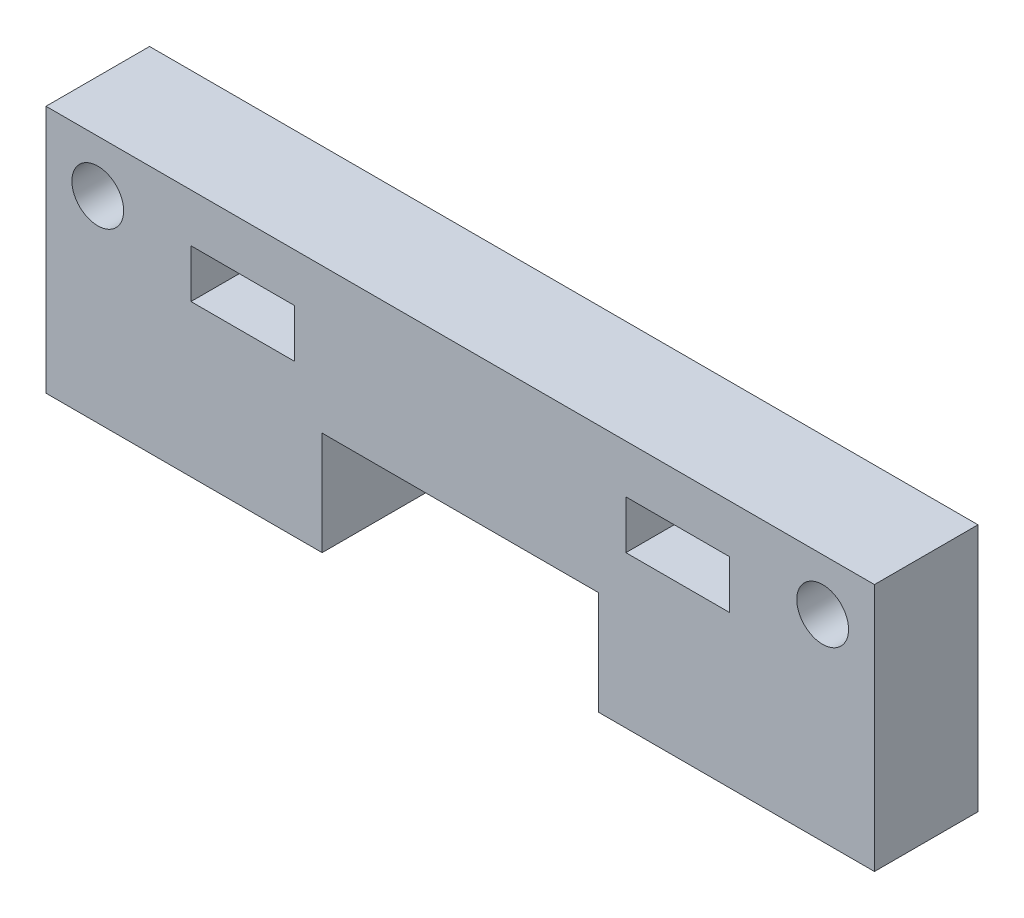
ISO-10303-21;
HEADER;
FILE_DESCRIPTION(('STEP AP214'),'2;1');
FILE_NAME('part.step','',(''),(''),'','','');
FILE_SCHEMA(('AUTOMOTIVE_DESIGN { 1 0 10303 214 1 1 1 1 }'));
ENDSEC;
DATA;
#1=APPLICATION_CONTEXT('core data for automotive mechanical design processes');
#2=APPLICATION_PROTOCOL_DEFINITION('international standard','automotive_design',2000,#1);
#3=PRODUCT_CONTEXT('',#1,'mechanical');
#4=PRODUCT('Part','Part','',(#3));
#5=PRODUCT_RELATED_PRODUCT_CATEGORY('part','',(#4));
#6=PRODUCT_DEFINITION_FORMATION('','',#4);
#7=PRODUCT_DEFINITION_CONTEXT('part definition',#1,'design');
#8=PRODUCT_DEFINITION('design','',#6,#7);
#9=PRODUCT_DEFINITION_SHAPE('','',#8);
#10=(LENGTH_UNIT() NAMED_UNIT(*) SI_UNIT(.MILLI.,.METRE.));
#11=(NAMED_UNIT(*) PLANE_ANGLE_UNIT() SI_UNIT($,.RADIAN.));
#12=(NAMED_UNIT(*) SI_UNIT($,.STERADIAN.) SOLID_ANGLE_UNIT());
#13=UNCERTAINTY_MEASURE_WITH_UNIT(LENGTH_MEASURE(1.E-05),#10,'distance_accuracy_value','');
#14=(GEOMETRIC_REPRESENTATION_CONTEXT(3) GLOBAL_UNCERTAINTY_ASSIGNED_CONTEXT((#13)) GLOBAL_UNIT_ASSIGNED_CONTEXT((#10,
#11,#12)) REPRESENTATION_CONTEXT('',''));
#15=CARTESIAN_POINT('',(0.,0.,0.));
#16=DIRECTION('',(0.,0.,1.));
#17=DIRECTION('',(1.,0.,0.));
#18=AXIS2_PLACEMENT_3D('',#15,#16,#17);
#19=CARTESIAN_POINT('',(0.,0.,0.));
#20=DIRECTION('',(0.,0.,-1.));
#21=DIRECTION('',(-1.,0.,0.));
#22=AXIS2_PLACEMENT_3D('',#19,#20,#21);
#23=PLANE('',#22);
#24=DIRECTION('',(1.,0.,0.));
#25=VECTOR('',#24,1.);
#26=CARTESIAN_POINT('',(35.56,12.2766666666667,0.));
#27=LINE('',#26,#25);
#28=CARTESIAN_POINT('',(35.56,12.2766666666667,0.));
#29=VERTEX_POINT('',#28);
#30=CARTESIAN_POINT('',(41.91,12.2766666666667,0.));
#31=VERTEX_POINT('',#30);
#32=EDGE_CURVE('E196',#29,#31,#27,.T.);
#33=ORIENTED_EDGE('',*,*,#32,.F.);
#34=DIRECTION('',(0.,-1.,0.));
#35=VECTOR('',#34,1.);
#36=CARTESIAN_POINT('',(35.56,12.2766666666667,0.));
#37=LINE('',#36,#35);
#38=CARTESIAN_POINT('',(35.56,9.31333333333334,0.));
#39=VERTEX_POINT('',#38);
#40=EDGE_CURVE('E177',#29,#39,#37,.T.);
#41=ORIENTED_EDGE('',*,*,#40,.T.);
#42=DIRECTION('',(1.,0.,0.));
#43=VECTOR('',#42,1.);
#44=CARTESIAN_POINT('',(35.56,9.31333333333334,0.));
#45=LINE('',#44,#43);
#46=CARTESIAN_POINT('',(41.91,9.31333333333334,0.));
#47=VERTEX_POINT('',#46);
#48=EDGE_CURVE('E198',#39,#47,#45,.T.);
#49=ORIENTED_EDGE('',*,*,#48,.T.);
#50=DIRECTION('',(0.,-1.,0.));
#51=VECTOR('',#50,1.);
#52=CARTESIAN_POINT('',(41.91,12.2766666666667,0.));
#53=LINE('',#52,#51);
#54=EDGE_CURVE('E187',#31,#47,#53,.T.);
#55=ORIENTED_EDGE('',*,*,#54,.F.);
#56=EDGE_LOOP('',(#33,#41,#49,#55));
#57=FACE_BOUND('',#56,.T.);
#58=CARTESIAN_POINT('',(47.625,12.065,0.));
#59=DIRECTION('',(0.,0.,1.));
#60=DIRECTION('',(1.,0.,0.));
#61=AXIS2_PLACEMENT_3D('',#58,#59,#60);
#62=CIRCLE('',#61,1.5875);
#63=CARTESIAN_POINT('',(49.2125,12.065,0.));
#64=VERTEX_POINT('',#63);
#65=EDGE_CURVE('E195',#64,#64,#62,.T.);
#66=ORIENTED_EDGE('',*,*,#65,.T.);
#67=EDGE_LOOP('',(#66));
#68=FACE_BOUND('',#67,.T.);
#69=CARTESIAN_POINT('',(3.175,12.065,0.));
#70=DIRECTION('',(0.,0.,1.));
#71=DIRECTION('',(1.,0.,0.));
#72=AXIS2_PLACEMENT_3D('',#69,#70,#71);
#73=CIRCLE('',#72,1.5875);
#74=CARTESIAN_POINT('',(4.7625,12.065,0.));
#75=VERTEX_POINT('',#74);
#76=EDGE_CURVE('E209',#75,#75,#73,.T.);
#77=ORIENTED_EDGE('',*,*,#76,.T.);
#78=EDGE_LOOP('',(#77));
#79=FACE_BOUND('',#78,.T.);
#80=DIRECTION('',(1.,0.,0.));
#81=VECTOR('',#80,1.);
#82=CARTESIAN_POINT('',(16.9333333333333,6.35,0.));
#83=LINE('',#82,#81);
#84=CARTESIAN_POINT('',(16.9333333333333,6.35,0.));
#85=VERTEX_POINT('',#84);
#86=CARTESIAN_POINT('',(33.8666666666667,6.35,0.));
#87=VERTEX_POINT('',#86);
#88=EDGE_CURVE('E223',#85,#87,#83,.T.);
#89=ORIENTED_EDGE('',*,*,#88,.F.);
#90=DIRECTION('',(0.,1.,0.));
#91=VECTOR('',#90,1.);
#92=CARTESIAN_POINT('',(16.9333333333333,0.,0.));
#93=LINE('',#92,#91);
#94=CARTESIAN_POINT('',(16.9333333333333,0.,0.));
#95=VERTEX_POINT('',#94);
#96=EDGE_CURVE('E231',#95,#85,#93,.T.);
#97=ORIENTED_EDGE('',*,*,#96,.F.);
#98=DIRECTION('',(1.,0.,0.));
#99=VECTOR('',#98,1.);
#100=CARTESIAN_POINT('',(0.,0.,0.));
#101=LINE('',#100,#99);
#102=CARTESIAN_POINT('',(0.,0.,0.));
#103=VERTEX_POINT('',#102);
#104=EDGE_CURVE('E255',#103,#95,#101,.T.);
#105=ORIENTED_EDGE('',*,*,#104,.F.);
#106=DIRECTION('',(0.,-1.,0.));
#107=VECTOR('',#106,1.);
#108=CARTESIAN_POINT('',(0.,0.,0.));
#109=LINE('',#108,#107);
#110=CARTESIAN_POINT('',(0.,15.24,0.));
#111=VERTEX_POINT('',#110);
#112=EDGE_CURVE('E239',#111,#103,#109,.T.);
#113=ORIENTED_EDGE('',*,*,#112,.F.);
#114=DIRECTION('',(-1.,0.,0.));
#115=VECTOR('',#114,1.);
#116=CARTESIAN_POINT('',(0.,15.24,0.));
#117=LINE('',#116,#115);
#118=CARTESIAN_POINT('',(50.8,15.24,0.));
#119=VERTEX_POINT('',#118);
#120=EDGE_CURVE('E243',#119,#111,#117,.T.);
#121=ORIENTED_EDGE('',*,*,#120,.F.);
#122=DIRECTION('',(0.,1.,0.));
#123=VECTOR('',#122,1.);
#124=CARTESIAN_POINT('',(50.8,0.,0.));
#125=LINE('',#124,#123);
#126=CARTESIAN_POINT('',(50.8,0.,0.));
#127=VERTEX_POINT('',#126);
#128=EDGE_CURVE('E258',#127,#119,#125,.T.);
#129=ORIENTED_EDGE('',*,*,#128,.F.);
#130=CARTESIAN_POINT('',(33.8666666666667,0.,0.));
#131=VERTEX_POINT('',#130);
#132=EDGE_CURVE('E254',#131,#127,#101,.T.);
#133=ORIENTED_EDGE('',*,*,#132,.F.);
#134=DIRECTION('',(0.,1.,0.));
#135=VECTOR('',#134,1.);
#136=CARTESIAN_POINT('',(33.8666666666667,0.,0.));
#137=LINE('',#136,#135);
#138=EDGE_CURVE('E228',#131,#87,#137,.T.);
#139=ORIENTED_EDGE('',*,*,#138,.T.);
#140=EDGE_LOOP('',(#89,#97,#105,#113,#121,#129,#133,#139));
#141=FACE_BOUND('',#140,.T.);
#142=DIRECTION('',(1.,0.,0.));
#143=VECTOR('',#142,1.);
#144=CARTESIAN_POINT('',(8.88999999999999,12.2766666666667,0.));
#145=LINE('',#144,#143);
#146=CARTESIAN_POINT('',(8.88999999999999,12.2766666666667,0.));
#147=VERTEX_POINT('',#146);
#148=CARTESIAN_POINT('',(15.24,12.2766666666667,0.));
#149=VERTEX_POINT('',#148);
#150=EDGE_CURVE('E50',#147,#149,#145,.T.);
#151=ORIENTED_EDGE('',*,*,#150,.F.);
#152=DIRECTION('',(0.,-1.,0.));
#153=VECTOR('',#152,1.);
#154=CARTESIAN_POINT('',(8.88999999999999,12.2766666666667,0.));
#155=LINE('',#154,#153);
#156=CARTESIAN_POINT('',(8.88999999999999,9.31333333333334,0.));
#157=VERTEX_POINT('',#156);
#158=EDGE_CURVE('E164',#147,#157,#155,.T.);
#159=ORIENTED_EDGE('',*,*,#158,.T.);
#160=DIRECTION('',(1.,0.,0.));
#161=VECTOR('',#160,1.);
#162=CARTESIAN_POINT('',(8.88999999999999,9.31333333333334,0.));
#163=LINE('',#162,#161);
#164=CARTESIAN_POINT('',(15.24,9.31333333333334,0.));
#165=VERTEX_POINT('',#164);
#166=EDGE_CURVE('E163',#157,#165,#163,.T.);
#167=ORIENTED_EDGE('',*,*,#166,.T.);
#168=DIRECTION('',(0.,-1.,0.));
#169=VECTOR('',#168,1.);
#170=CARTESIAN_POINT('',(15.24,12.2766666666667,0.));
#171=LINE('',#170,#169);
#172=EDGE_CURVE('E306',#149,#165,#171,.T.);
#173=ORIENTED_EDGE('',*,*,#172,.F.);
#174=EDGE_LOOP('',(#151,#159,#167,#173));
#175=FACE_BOUND('',#174,.T.);
#176=ADVANCED_FACE('F35',(#57,#68,#79,#141,#175),#23,.T.);
#177=CARTESIAN_POINT('',(0.,0.,6.35));
#178=DIRECTION('',(0.,1.,0.));
#179=DIRECTION('',(0.,0.,1.));
#180=AXIS2_PLACEMENT_3D('',#177,#178,#179);
#181=PLANE('',#180);
#182=DIRECTION('',(0.,0.,-1.));
#183=VECTOR('',#182,1.);
#184=CARTESIAN_POINT('',(16.9333333333333,0.,0.));
#185=LINE('',#184,#183);
#186=CARTESIAN_POINT('',(16.9333333333333,0.,6.35000000000002));
#187=VERTEX_POINT('',#186);
#188=EDGE_CURVE('E215',#187,#95,#185,.T.);
#189=ORIENTED_EDGE('',*,*,#188,.F.);
#190=DIRECTION('',(1.,0.,0.));
#191=VECTOR('',#190,1.);
#192=CARTESIAN_POINT('',(0.,0.,6.35));
#193=LINE('',#192,#191);
#194=CARTESIAN_POINT('',(0.,0.,6.35));
#195=VERTEX_POINT('',#194);
#196=EDGE_CURVE('E244',#195,#187,#193,.T.);
#197=ORIENTED_EDGE('',*,*,#196,.F.);
#198=DIRECTION('',(0.,0.,-1.));
#199=VECTOR('',#198,1.);
#200=CARTESIAN_POINT('',(0.,0.,6.35));
#201=LINE('',#200,#199);
#202=EDGE_CURVE('E269',#195,#103,#201,.T.);
#203=ORIENTED_EDGE('',*,*,#202,.T.);
#204=ORIENTED_EDGE('',*,*,#104,.T.);
#205=EDGE_LOOP('',(#189,#197,#203,#204));
#206=FACE_BOUND('',#205,.T.);
#207=ADVANCED_FACE('F296',(#206),#181,.F.);
#208=DIRECTION('',(0.,0.,1.));
#209=VECTOR('',#208,1.);
#210=CARTESIAN_POINT('',(33.8666666666667,0.,0.));
#211=LINE('',#210,#209);
#212=CARTESIAN_POINT('',(33.8666666666667,0.,6.35000000000002));
#213=VERTEX_POINT('',#212);
#214=EDGE_CURVE('E217',#131,#213,#211,.T.);
#215=ORIENTED_EDGE('',*,*,#214,.F.);
#216=ORIENTED_EDGE('',*,*,#132,.T.);
#217=DIRECTION('',(0.,0.,-1.));
#218=VECTOR('',#217,1.);
#219=CARTESIAN_POINT('',(50.8,0.,6.35));
#220=LINE('',#219,#218);
#221=CARTESIAN_POINT('',(50.8,0.,6.35));
#222=VERTEX_POINT('',#221);
#223=EDGE_CURVE('E266',#222,#127,#220,.T.);
#224=ORIENTED_EDGE('',*,*,#223,.F.);
#225=EDGE_CURVE('E242',#213,#222,#193,.T.);
#226=ORIENTED_EDGE('',*,*,#225,.F.);
#227=EDGE_LOOP('',(#215,#216,#224,#226));
#228=FACE_BOUND('',#227,.T.);
#229=ADVANCED_FACE('F362',(#228),#181,.F.);
#230=CARTESIAN_POINT('',(0.,0.,6.35));
#231=DIRECTION('',(1.,0.,0.));
#232=DIRECTION('',(0.,0.,-1.));
#233=AXIS2_PLACEMENT_3D('',#230,#231,#232);
#234=PLANE('',#233);
#235=ORIENTED_EDGE('',*,*,#112,.T.);
#236=ORIENTED_EDGE('',*,*,#202,.F.);
#237=DIRECTION('',(0.,-1.,0.));
#238=VECTOR('',#237,1.);
#239=CARTESIAN_POINT('',(0.,0.,6.35));
#240=LINE('',#239,#238);
#241=CARTESIAN_POINT('',(0.,15.24,6.35));
#242=VERTEX_POINT('',#241);
#243=EDGE_CURVE('E240',#242,#195,#240,.T.);
#244=ORIENTED_EDGE('',*,*,#243,.F.);
#245=DIRECTION('',(0.,0.,-1.));
#246=VECTOR('',#245,1.);
#247=CARTESIAN_POINT('',(0.,15.24,6.35));
#248=LINE('',#247,#246);
#249=EDGE_CURVE('E251',#242,#111,#248,.T.);
#250=ORIENTED_EDGE('',*,*,#249,.T.);
#251=EDGE_LOOP('',(#235,#236,#244,#250));
#252=FACE_BOUND('',#251,.T.);
#253=ADVANCED_FACE('F37',(#252),#234,.F.);
#254=CARTESIAN_POINT('',(50.8,0.,6.35));
#255=DIRECTION('',(-1.,0.,0.));
#256=DIRECTION('',(0.,0.,1.));
#257=AXIS2_PLACEMENT_3D('',#254,#255,#256);
#258=PLANE('',#257);
#259=ORIENTED_EDGE('',*,*,#128,.T.);
#260=DIRECTION('',(0.,0.,-1.));
#261=VECTOR('',#260,1.);
#262=CARTESIAN_POINT('',(50.8,15.24,6.35));
#263=LINE('',#262,#261);
#264=CARTESIAN_POINT('',(50.8,15.24,6.35));
#265=VERTEX_POINT('',#264);
#266=EDGE_CURVE('E263',#265,#119,#263,.T.);
#267=ORIENTED_EDGE('',*,*,#266,.F.);
#268=DIRECTION('',(0.,1.,0.));
#269=VECTOR('',#268,1.);
#270=CARTESIAN_POINT('',(50.8,0.,6.35));
#271=LINE('',#270,#269);
#272=EDGE_CURVE('E247',#222,#265,#271,.T.);
#273=ORIENTED_EDGE('',*,*,#272,.F.);
#274=ORIENTED_EDGE('',*,*,#223,.T.);
#275=EDGE_LOOP('',(#259,#267,#273,#274));
#276=FACE_BOUND('',#275,.T.);
#277=ADVANCED_FACE('F357',(#276),#258,.F.);
#278=CARTESIAN_POINT('',(0.,15.24,6.35));
#279=DIRECTION('',(0.,-1.,0.));
#280=DIRECTION('',(0.,0.,-1.));
#281=AXIS2_PLACEMENT_3D('',#278,#279,#280);
#282=PLANE('',#281);
#283=ORIENTED_EDGE('',*,*,#120,.T.);
#284=ORIENTED_EDGE('',*,*,#249,.F.);
#285=DIRECTION('',(-1.,0.,0.));
#286=VECTOR('',#285,1.);
#287=CARTESIAN_POINT('',(0.,15.24,6.35));
#288=LINE('',#287,#286);
#289=EDGE_CURVE('E249',#265,#242,#288,.T.);
#290=ORIENTED_EDGE('',*,*,#289,.F.);
#291=ORIENTED_EDGE('',*,*,#266,.T.);
#292=EDGE_LOOP('',(#283,#284,#290,#291));
#293=FACE_BOUND('',#292,.T.);
#294=ADVANCED_FACE('F353',(#293),#282,.F.);
#295=CARTESIAN_POINT('',(0.,0.,6.35));
#296=DIRECTION('',(0.,0.,-1.));
#297=DIRECTION('',(-1.,0.,0.));
#298=AXIS2_PLACEMENT_3D('',#295,#296,#297);
#299=PLANE('',#298);
#300=DIRECTION('',(0.,-1.,0.));
#301=VECTOR('',#300,1.);
#302=CARTESIAN_POINT('',(8.88999999999999,0.,6.35));
#303=LINE('',#302,#301);
#304=CARTESIAN_POINT('',(8.88999999999999,12.2766666666667,6.35));
#305=VERTEX_POINT('',#304);
#306=CARTESIAN_POINT('',(8.88999999999999,9.31333333333334,6.35));
#307=VERTEX_POINT('',#306);
#308=EDGE_CURVE('E11',#305,#307,#303,.T.);
#309=ORIENTED_EDGE('',*,*,#308,.F.);
#310=DIRECTION('',(1.,0.,0.));
#311=VECTOR('',#310,1.);
#312=CARTESIAN_POINT('',(8.88999999999999,12.2766666666667,6.35));
#313=LINE('',#312,#311);
#314=CARTESIAN_POINT('',(15.24,12.2766666666667,6.35));
#315=VERTEX_POINT('',#314);
#316=EDGE_CURVE('E188',#305,#315,#313,.T.);
#317=ORIENTED_EDGE('',*,*,#316,.T.);
#318=DIRECTION('',(0.,-1.,0.));
#319=VECTOR('',#318,1.);
#320=CARTESIAN_POINT('',(15.24,0.,6.35));
#321=LINE('',#320,#319);
#322=CARTESIAN_POINT('',(15.24,9.31333333333334,6.35));
#323=VERTEX_POINT('',#322);
#324=EDGE_CURVE('E43',#315,#323,#321,.T.);
#325=ORIENTED_EDGE('',*,*,#324,.T.);
#326=DIRECTION('',(1.,0.,0.));
#327=VECTOR('',#326,1.);
#328=CARTESIAN_POINT('',(8.88999999999999,9.31333333333334,6.35));
#329=LINE('',#328,#327);
#330=EDGE_CURVE('E160',#307,#323,#329,.T.);
#331=ORIENTED_EDGE('',*,*,#330,.F.);
#332=EDGE_LOOP('',(#309,#317,#325,#331));
#333=FACE_BOUND('',#332,.T.);
#334=ORIENTED_EDGE('',*,*,#289,.T.);
#335=ORIENTED_EDGE('',*,*,#243,.T.);
#336=ORIENTED_EDGE('',*,*,#196,.T.);
#337=DIRECTION('',(0.,1.,0.));
#338=VECTOR('',#337,1.);
#339=CARTESIAN_POINT('',(16.9333333333333,0.,6.35000000000002));
#340=LINE('',#339,#338);
#341=CARTESIAN_POINT('',(16.9333333333333,6.35,6.35000000000002));
#342=VERTEX_POINT('',#341);
#343=EDGE_CURVE('E233',#187,#342,#340,.T.);
#344=ORIENTED_EDGE('',*,*,#343,.T.);
#345=DIRECTION('',(1.,0.,0.));
#346=VECTOR('',#345,1.);
#347=CARTESIAN_POINT('',(0.,6.35,6.35));
#348=LINE('',#347,#346);
#349=CARTESIAN_POINT('',(33.8666666666667,6.35,6.35000000000002));
#350=VERTEX_POINT('',#349);
#351=EDGE_CURVE('E236',#342,#350,#348,.T.);
#352=ORIENTED_EDGE('',*,*,#351,.T.);
#353=DIRECTION('',(0.,1.,0.));
#354=VECTOR('',#353,1.);
#355=CARTESIAN_POINT('',(33.8666666666667,0.,6.35000000000002));
#356=LINE('',#355,#354);
#357=EDGE_CURVE('E220',#213,#350,#356,.T.);
#358=ORIENTED_EDGE('',*,*,#357,.F.);
#359=ORIENTED_EDGE('',*,*,#225,.T.);
#360=ORIENTED_EDGE('',*,*,#272,.T.);
#361=EDGE_LOOP('',(#334,#335,#336,#344,#352,#358,#359,#360));
#362=FACE_BOUND('',#361,.T.);
#363=CARTESIAN_POINT('',(47.625,12.065,6.35));
#364=DIRECTION('',(0.,0.,1.));
#365=DIRECTION('',(1.,0.,0.));
#366=AXIS2_PLACEMENT_3D('',#363,#364,#365);
#367=CIRCLE('',#366,1.5875);
#368=CARTESIAN_POINT('',(49.2125,12.065,6.35));
#369=VERTEX_POINT('',#368);
#370=EDGE_CURVE('E203',#369,#369,#367,.T.);
#371=ORIENTED_EDGE('',*,*,#370,.F.);
#372=EDGE_LOOP('',(#371));
#373=FACE_BOUND('',#372,.T.);
#374=CARTESIAN_POINT('',(3.175,12.065,6.35));
#375=DIRECTION('',(0.,0.,1.));
#376=DIRECTION('',(1.,0.,0.));
#377=AXIS2_PLACEMENT_3D('',#374,#375,#376);
#378=CIRCLE('',#377,1.5875);
#379=CARTESIAN_POINT('',(4.7625,12.065,6.35));
#380=VERTEX_POINT('',#379);
#381=EDGE_CURVE('E206',#380,#380,#378,.T.);
#382=ORIENTED_EDGE('',*,*,#381,.F.);
#383=EDGE_LOOP('',(#382));
#384=FACE_BOUND('',#383,.T.);
#385=DIRECTION('',(0.,-1.,0.));
#386=VECTOR('',#385,1.);
#387=CARTESIAN_POINT('',(35.56,0.,6.35));
#388=LINE('',#387,#386);
#389=CARTESIAN_POINT('',(35.56,12.2766666666667,6.35));
#390=VERTEX_POINT('',#389);
#391=CARTESIAN_POINT('',(35.56,9.31333333333334,6.35));
#392=VERTEX_POINT('',#391);
#393=EDGE_CURVE('E275',#390,#392,#388,.T.);
#394=ORIENTED_EDGE('',*,*,#393,.F.);
#395=DIRECTION('',(1.,0.,0.));
#396=VECTOR('',#395,1.);
#397=CARTESIAN_POINT('',(35.56,12.2766666666667,6.35));
#398=LINE('',#397,#396);
#399=CARTESIAN_POINT('',(41.91,12.2766666666667,6.35));
#400=VERTEX_POINT('',#399);
#401=EDGE_CURVE('E192',#390,#400,#398,.T.);
#402=ORIENTED_EDGE('',*,*,#401,.T.);
#403=DIRECTION('',(0.,-1.,0.));
#404=VECTOR('',#403,1.);
#405=CARTESIAN_POINT('',(41.91,0.,6.35));
#406=LINE('',#405,#404);
#407=CARTESIAN_POINT('',(41.91,9.31333333333334,6.35));
#408=VERTEX_POINT('',#407);
#409=EDGE_CURVE('E272',#400,#408,#406,.T.);
#410=ORIENTED_EDGE('',*,*,#409,.T.);
#411=DIRECTION('',(1.,0.,0.));
#412=VECTOR('',#411,1.);
#413=CARTESIAN_POINT('',(35.56,9.31333333333334,6.35));
#414=LINE('',#413,#412);
#415=EDGE_CURVE('E183',#392,#408,#414,.T.);
#416=ORIENTED_EDGE('',*,*,#415,.F.);
#417=EDGE_LOOP('',(#394,#402,#410,#416));
#418=FACE_BOUND('',#417,.T.);
#419=ADVANCED_FACE('F167',(#333,#362,#373,#384,#418),#299,.F.);
#420=CARTESIAN_POINT('',(0.,6.35,2.7589655172414));
#421=DIRECTION('',(0.,1.,0.));
#422=DIRECTION('',(-1.,0.,0.));
#423=AXIS2_PLACEMENT_3D('',#420,#421,#422);
#424=PLANE('',#423);
#425=DIRECTION('',(0.,0.,-1.));
#426=VECTOR('',#425,1.);
#427=CARTESIAN_POINT('',(16.9333333333333,6.35,0.));
#428=LINE('',#427,#426);
#429=EDGE_CURVE('E212',#342,#85,#428,.T.);
#430=ORIENTED_EDGE('',*,*,#429,.T.);
#431=ORIENTED_EDGE('',*,*,#88,.T.);
#432=DIRECTION('',(0.,0.,1.));
#433=VECTOR('',#432,1.);
#434=CARTESIAN_POINT('',(33.8666666666667,6.35,0.));
#435=LINE('',#434,#433);
#436=EDGE_CURVE('E218',#87,#350,#435,.T.);
#437=ORIENTED_EDGE('',*,*,#436,.T.);
#438=ORIENTED_EDGE('',*,*,#351,.F.);
#439=EDGE_LOOP('',(#430,#431,#437,#438));
#440=FACE_BOUND('',#439,.T.);
#441=ADVANCED_FACE('F341',(#440),#424,.F.);
#442=CARTESIAN_POINT('',(16.9333333333333,0.,0.));
#443=DIRECTION('',(1.,0.,0.));
#444=DIRECTION('',(0.,1.,0.));
#445=AXIS2_PLACEMENT_3D('',#442,#443,#444);
#446=PLANE('',#445);
#447=ORIENTED_EDGE('',*,*,#429,.F.);
#448=ORIENTED_EDGE('',*,*,#343,.F.);
#449=ORIENTED_EDGE('',*,*,#188,.T.);
#450=ORIENTED_EDGE('',*,*,#96,.T.);
#451=EDGE_LOOP('',(#447,#448,#449,#450));
#452=FACE_BOUND('',#451,.T.);
#453=ADVANCED_FACE('F344',(#452),#446,.T.);
#454=CARTESIAN_POINT('',(33.8666666666667,0.,0.));
#455=DIRECTION('',(-1.,0.,0.));
#456=DIRECTION('',(0.,-1.,0.));
#457=AXIS2_PLACEMENT_3D('',#454,#455,#456);
#458=PLANE('',#457);
#459=ORIENTED_EDGE('',*,*,#436,.F.);
#460=ORIENTED_EDGE('',*,*,#138,.F.);
#461=ORIENTED_EDGE('',*,*,#214,.T.);
#462=ORIENTED_EDGE('',*,*,#357,.T.);
#463=EDGE_LOOP('',(#459,#460,#461,#462));
#464=FACE_BOUND('',#463,.T.);
#465=ADVANCED_FACE('F339',(#464),#458,.T.);
#466=CARTESIAN_POINT('',(3.175,12.065,0.));
#467=DIRECTION('',(0.,0.,1.));
#468=DIRECTION('',(1.,0.,0.));
#469=AXIS2_PLACEMENT_3D('',#466,#467,#468);
#470=CYLINDRICAL_SURFACE('',#469,1.5875);
#471=ORIENTED_EDGE('',*,*,#76,.F.);
#472=EDGE_LOOP('',(#471));
#473=FACE_BOUND('',#472,.T.);
#474=ORIENTED_EDGE('',*,*,#381,.T.);
#475=EDGE_LOOP('',(#474));
#476=FACE_BOUND('',#475,.T.);
#477=ADVANCED_FACE('F335',(#473,#476),#470,.F.);
#478=CARTESIAN_POINT('',(47.625,12.065,0.));
#479=DIRECTION('',(0.,0.,1.));
#480=DIRECTION('',(1.,0.,0.));
#481=AXIS2_PLACEMENT_3D('',#478,#479,#480);
#482=CYLINDRICAL_SURFACE('',#481,1.5875);
#483=ORIENTED_EDGE('',*,*,#65,.F.);
#484=EDGE_LOOP('',(#483));
#485=FACE_BOUND('',#484,.T.);
#486=ORIENTED_EDGE('',*,*,#370,.T.);
#487=EDGE_LOOP('',(#486));
#488=FACE_BOUND('',#487,.T.);
#489=ADVANCED_FACE('F326',(#485,#488),#482,.F.);
#490=CARTESIAN_POINT('',(35.56,6.35,6.35));
#491=DIRECTION('',(1.,0.,0.));
#492=DIRECTION('',(0.,0.,-1.));
#493=AXIS2_PLACEMENT_3D('',#490,#491,#492);
#494=PLANE('',#493);
#495=ORIENTED_EDGE('',*,*,#393,.T.);
#496=DIRECTION('',(0.,0.,-1.));
#497=VECTOR('',#496,1.);
#498=CARTESIAN_POINT('',(35.56,9.31333333333334,6.35));
#499=LINE('',#498,#497);
#500=EDGE_CURVE('E174',#392,#39,#499,.T.);
#501=ORIENTED_EDGE('',*,*,#500,.T.);
#502=ORIENTED_EDGE('',*,*,#40,.F.);
#503=DIRECTION('',(0.,0.,-1.));
#504=VECTOR('',#503,1.);
#505=CARTESIAN_POINT('',(35.56,12.2766666666667,6.35));
#506=LINE('',#505,#504);
#507=EDGE_CURVE('E181',#390,#29,#506,.T.);
#508=ORIENTED_EDGE('',*,*,#507,.F.);
#509=EDGE_LOOP('',(#495,#501,#502,#508));
#510=FACE_BOUND('',#509,.T.);
#511=ADVANCED_FACE('F280',(#510),#494,.T.);
#512=CARTESIAN_POINT('',(41.91,6.35,6.35));
#513=DIRECTION('',(1.,0.,0.));
#514=DIRECTION('',(0.,0.,-1.));
#515=AXIS2_PLACEMENT_3D('',#512,#513,#514);
#516=PLANE('',#515);
#517=DIRECTION('',(0.,0.,-1.));
#518=VECTOR('',#517,1.);
#519=CARTESIAN_POINT('',(41.91,12.2766666666667,6.35));
#520=LINE('',#519,#518);
#521=EDGE_CURVE('E178',#400,#31,#520,.T.);
#522=ORIENTED_EDGE('',*,*,#521,.T.);
#523=ORIENTED_EDGE('',*,*,#54,.T.);
#524=DIRECTION('',(0.,0.,-1.));
#525=VECTOR('',#524,1.);
#526=CARTESIAN_POINT('',(41.91,9.31333333333334,6.35));
#527=LINE('',#526,#525);
#528=EDGE_CURVE('E184',#408,#47,#527,.T.);
#529=ORIENTED_EDGE('',*,*,#528,.F.);
#530=ORIENTED_EDGE('',*,*,#409,.F.);
#531=EDGE_LOOP('',(#522,#523,#529,#530));
#532=FACE_BOUND('',#531,.T.);
#533=ADVANCED_FACE('F288',(#532),#516,.F.);
#534=CARTESIAN_POINT('',(35.56,12.2766666666667,6.35));
#535=DIRECTION('',(0.,-1.,0.));
#536=DIRECTION('',(1.,0.,0.));
#537=AXIS2_PLACEMENT_3D('',#534,#535,#536);
#538=PLANE('',#537);
#539=ORIENTED_EDGE('',*,*,#521,.F.);
#540=ORIENTED_EDGE('',*,*,#401,.F.);
#541=ORIENTED_EDGE('',*,*,#507,.T.);
#542=ORIENTED_EDGE('',*,*,#32,.T.);
#543=EDGE_LOOP('',(#539,#540,#541,#542));
#544=FACE_BOUND('',#543,.T.);
#545=ADVANCED_FACE('F291',(#544),#538,.T.);
#546=CARTESIAN_POINT('',(35.56,9.31333333333334,6.35));
#547=DIRECTION('',(0.,-1.,0.));
#548=DIRECTION('',(0.,0.,1.));
#549=AXIS2_PLACEMENT_3D('',#546,#547,#548);
#550=PLANE('',#549);
#551=ORIENTED_EDGE('',*,*,#528,.T.);
#552=ORIENTED_EDGE('',*,*,#48,.F.);
#553=ORIENTED_EDGE('',*,*,#500,.F.);
#554=ORIENTED_EDGE('',*,*,#415,.T.);
#555=EDGE_LOOP('',(#551,#552,#553,#554));
#556=FACE_BOUND('',#555,.T.);
#557=ADVANCED_FACE('F285',(#556),#550,.F.);
#558=CARTESIAN_POINT('',(8.88999999999999,6.35,6.35));
#559=DIRECTION('',(1.,0.,0.));
#560=DIRECTION('',(0.,0.,-1.));
#561=AXIS2_PLACEMENT_3D('',#558,#559,#560);
#562=PLANE('',#561);
#563=ORIENTED_EDGE('',*,*,#308,.T.);
#564=DIRECTION('',(0.,0.,-1.));
#565=VECTOR('',#564,1.);
#566=CARTESIAN_POINT('',(8.88999999999999,9.31333333333334,6.35));
#567=LINE('',#566,#565);
#568=EDGE_CURVE('E152',#307,#157,#567,.T.);
#569=ORIENTED_EDGE('',*,*,#568,.T.);
#570=ORIENTED_EDGE('',*,*,#158,.F.);
#571=DIRECTION('',(0.,0.,-1.));
#572=VECTOR('',#571,1.);
#573=CARTESIAN_POINT('',(8.88999999999999,12.2766666666667,6.35));
#574=LINE('',#573,#572);
#575=EDGE_CURVE('E154',#305,#147,#574,.T.);
#576=ORIENTED_EDGE('',*,*,#575,.F.);
#577=EDGE_LOOP('',(#563,#569,#570,#576));
#578=FACE_BOUND('',#577,.T.);
#579=ADVANCED_FACE('F150',(#578),#562,.T.);
#580=CARTESIAN_POINT('',(15.24,6.35,6.35));
#581=DIRECTION('',(1.,0.,0.));
#582=DIRECTION('',(0.,0.,-1.));
#583=AXIS2_PLACEMENT_3D('',#580,#581,#582);
#584=PLANE('',#583);
#585=DIRECTION('',(0.,0.,-1.));
#586=VECTOR('',#585,1.);
#587=CARTESIAN_POINT('',(15.24,12.2766666666667,6.35));
#588=LINE('',#587,#586);
#589=EDGE_CURVE('E165',#315,#149,#588,.T.);
#590=ORIENTED_EDGE('',*,*,#589,.T.);
#591=ORIENTED_EDGE('',*,*,#172,.T.);
#592=DIRECTION('',(0.,0.,-1.));
#593=VECTOR('',#592,1.);
#594=CARTESIAN_POINT('',(15.24,9.31333333333334,6.35));
#595=LINE('',#594,#593);
#596=EDGE_CURVE('E58',#323,#165,#595,.T.);
#597=ORIENTED_EDGE('',*,*,#596,.F.);
#598=ORIENTED_EDGE('',*,*,#324,.F.);
#599=EDGE_LOOP('',(#590,#591,#597,#598));
#600=FACE_BOUND('',#599,.T.);
#601=ADVANCED_FACE('F312',(#600),#584,.F.);
#602=CARTESIAN_POINT('',(8.88999999999999,12.2766666666667,6.35));
#603=DIRECTION('',(0.,-1.,0.));
#604=DIRECTION('',(1.,0.,0.));
#605=AXIS2_PLACEMENT_3D('',#602,#603,#604);
#606=PLANE('',#605);
#607=ORIENTED_EDGE('',*,*,#589,.F.);
#608=ORIENTED_EDGE('',*,*,#316,.F.);
#609=ORIENTED_EDGE('',*,*,#575,.T.);
#610=ORIENTED_EDGE('',*,*,#150,.T.);
#611=EDGE_LOOP('',(#607,#608,#609,#610));
#612=FACE_BOUND('',#611,.T.);
#613=ADVANCED_FACE('F313',(#612),#606,.T.);
#614=CARTESIAN_POINT('',(8.88999999999999,9.31333333333334,6.35));
#615=DIRECTION('',(0.,-1.,0.));
#616=DIRECTION('',(0.,0.,1.));
#617=AXIS2_PLACEMENT_3D('',#614,#615,#616);
#618=PLANE('',#617);
#619=ORIENTED_EDGE('',*,*,#596,.T.);
#620=ORIENTED_EDGE('',*,*,#166,.F.);
#621=ORIENTED_EDGE('',*,*,#568,.F.);
#622=ORIENTED_EDGE('',*,*,#330,.T.);
#623=EDGE_LOOP('',(#619,#620,#621,#622));
#624=FACE_BOUND('',#623,.T.);
#625=ADVANCED_FACE('F159',(#624),#618,.F.);
#626=CLOSED_SHELL('',(#176,#207,#229,#253,#277,#294,#419,#441,#453,#465,#477,#489,#511,#533,
#545,#557,#579,#601,#613,#625));
#627=MANIFOLD_SOLID_BREP('B2',#626);
#628=ADVANCED_BREP_SHAPE_REPRESENTATION('',(#18,#627),#14);
#629=SHAPE_DEFINITION_REPRESENTATION(#9,#628);
ENDSEC;
END-ISO-10303-21;
